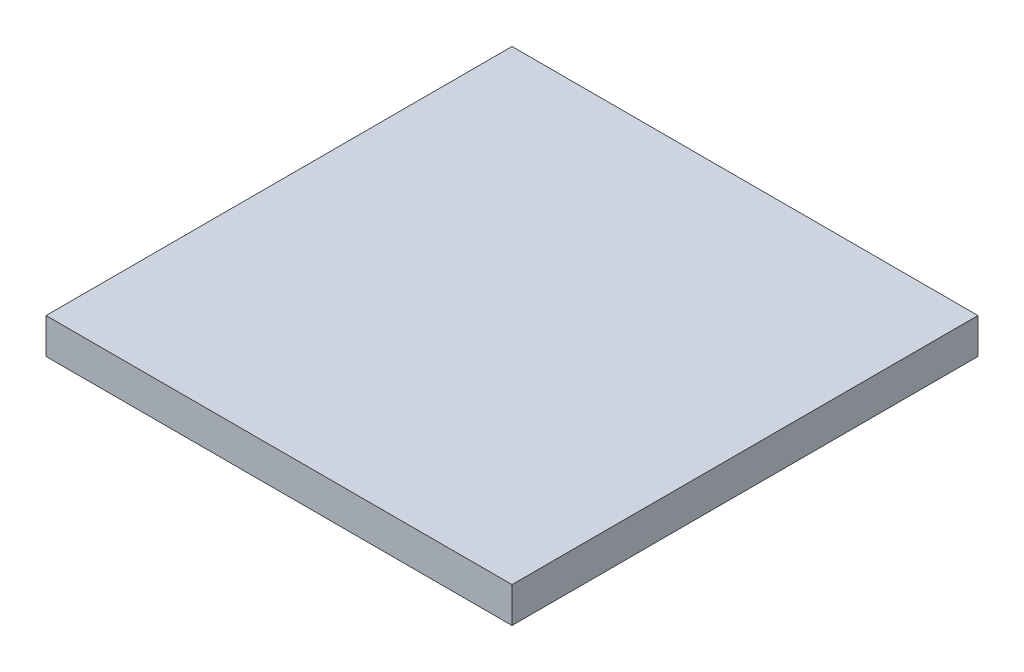
ISO-10303-21;
HEADER;
FILE_DESCRIPTION(('STEP AP214'),'2;1');
FILE_NAME('part.step','',(''),(''),'','','');
FILE_SCHEMA(('AUTOMOTIVE_DESIGN { 1 0 10303 214 1 1 1 1 }'));
ENDSEC;
DATA;
#1=APPLICATION_CONTEXT('core data for automotive mechanical design processes');
#2=APPLICATION_PROTOCOL_DEFINITION('international standard','automotive_design',2000,#1);
#3=PRODUCT_CONTEXT('',#1,'mechanical');
#4=PRODUCT('Part','Part','',(#3));
#5=PRODUCT_RELATED_PRODUCT_CATEGORY('part','',(#4));
#6=PRODUCT_DEFINITION_FORMATION('','',#4);
#7=PRODUCT_DEFINITION_CONTEXT('part definition',#1,'design');
#8=PRODUCT_DEFINITION('design','',#6,#7);
#9=PRODUCT_DEFINITION_SHAPE('','',#8);
#10=(LENGTH_UNIT() NAMED_UNIT(*) SI_UNIT(.MILLI.,.METRE.));
#11=(NAMED_UNIT(*) PLANE_ANGLE_UNIT() SI_UNIT($,.RADIAN.));
#12=(NAMED_UNIT(*) SI_UNIT($,.STERADIAN.) SOLID_ANGLE_UNIT());
#13=UNCERTAINTY_MEASURE_WITH_UNIT(LENGTH_MEASURE(1.E-05),#10,'distance_accuracy_value','');
#14=(GEOMETRIC_REPRESENTATION_CONTEXT(3) GLOBAL_UNCERTAINTY_ASSIGNED_CONTEXT((#13)) GLOBAL_UNIT_ASSIGNED_CONTEXT((#10,
#11,#12)) REPRESENTATION_CONTEXT('',''));
#15=CARTESIAN_POINT('',(0.,0.,0.));
#16=DIRECTION('',(0.,0.,1.));
#17=DIRECTION('',(1.,0.,0.));
#18=AXIS2_PLACEMENT_3D('',#15,#16,#17);
#19=CARTESIAN_POINT('',(0.,10.,-7.76269662921349));
#20=DIRECTION('',(-1.,0.,0.));
#21=DIRECTION('',(0.,0.,1.));
#22=AXIS2_PLACEMENT_3D('',#19,#20,#21);
#23=PLANE('',#22);
#24=DIRECTION('',(0.,0.,-1.));
#25=VECTOR('',#24,1.);
#26=CARTESIAN_POINT('',(0.,0.,-7.76269662921349));
#27=LINE('',#26,#25);
#28=CARTESIAN_POINT('',(0.,0.,-7.76269662921349));
#29=VERTEX_POINT('',#28);
#30=CARTESIAN_POINT('',(0.,0.,-139.212696629214));
#31=VERTEX_POINT('',#30);
#32=EDGE_CURVE('E102',#29,#31,#27,.T.);
#33=ORIENTED_EDGE('',*,*,#32,.T.);
#34=DIRECTION('',(0.,-1.,0.));
#35=VECTOR('',#34,1.);
#36=CARTESIAN_POINT('',(0.,10.,-139.212696629214));
#37=LINE('',#36,#35);
#38=CARTESIAN_POINT('',(0.,10.,-139.212696629214));
#39=VERTEX_POINT('',#38);
#40=EDGE_CURVE('E11',#39,#31,#37,.T.);
#41=ORIENTED_EDGE('',*,*,#40,.F.);
#42=DIRECTION('',(0.,0.,-1.));
#43=VECTOR('',#42,1.);
#44=CARTESIAN_POINT('',(0.,10.,-7.76269662921349));
#45=LINE('',#44,#43);
#46=CARTESIAN_POINT('',(0.,10.,-7.76269662921349));
#47=VERTEX_POINT('',#46);
#48=EDGE_CURVE('E90',#47,#39,#45,.T.);
#49=ORIENTED_EDGE('',*,*,#48,.F.);
#50=DIRECTION('',(0.,-1.,0.));
#51=VECTOR('',#50,1.);
#52=CARTESIAN_POINT('',(0.,10.,-7.76269662921349));
#53=LINE('',#52,#51);
#54=EDGE_CURVE('E98',#47,#29,#53,.T.);
#55=ORIENTED_EDGE('',*,*,#54,.T.);
#56=EDGE_LOOP('',(#33,#41,#49,#55));
#57=FACE_BOUND('',#56,.T.);
#58=ADVANCED_FACE('F39',(#57),#23,.F.);
#59=CARTESIAN_POINT('',(0.,10.,-139.212696629214));
#60=DIRECTION('',(0.,0.,1.));
#61=DIRECTION('',(1.,0.,0.));
#62=AXIS2_PLACEMENT_3D('',#59,#60,#61);
#63=PLANE('',#62);
#64=DIRECTION('',(-1.,0.,0.));
#65=VECTOR('',#64,1.);
#66=CARTESIAN_POINT('',(0.,0.,-139.212696629214));
#67=LINE('',#66,#65);
#68=CARTESIAN_POINT('',(-131.448329588015,0.,-139.212696629213));
#69=VERTEX_POINT('',#68);
#70=EDGE_CURVE('E94',#31,#69,#67,.T.);
#71=ORIENTED_EDGE('',*,*,#70,.T.);
#72=DIRECTION('',(0.,-1.,0.));
#73=VECTOR('',#72,1.);
#74=CARTESIAN_POINT('',(-131.448329588015,10.,-139.212696629213));
#75=LINE('',#74,#73);
#76=CARTESIAN_POINT('',(-131.448329588015,10.,-139.212696629213));
#77=VERTEX_POINT('',#76);
#78=EDGE_CURVE('E47',#77,#69,#75,.T.);
#79=ORIENTED_EDGE('',*,*,#78,.F.);
#80=DIRECTION('',(-1.,0.,0.));
#81=VECTOR('',#80,1.);
#82=CARTESIAN_POINT('',(0.,10.,-139.212696629214));
#83=LINE('',#82,#81);
#84=EDGE_CURVE('E85',#39,#77,#83,.T.);
#85=ORIENTED_EDGE('',*,*,#84,.F.);
#86=ORIENTED_EDGE('',*,*,#40,.T.);
#87=EDGE_LOOP('',(#71,#79,#85,#86));
#88=FACE_BOUND('',#87,.T.);
#89=ADVANCED_FACE('F93',(#88),#63,.F.);
#90=CARTESIAN_POINT('',(-131.448329588015,10.,-7.76269662921349));
#91=DIRECTION('',(1.,0.,0.));
#92=DIRECTION('',(0.,0.,-1.));
#93=AXIS2_PLACEMENT_3D('',#90,#91,#92);
#94=PLANE('',#93);
#95=DIRECTION('',(0.,0.,1.));
#96=VECTOR('',#95,1.);
#97=CARTESIAN_POINT('',(-131.448329588015,0.,-7.76269662921349));
#98=LINE('',#97,#96);
#99=CARTESIAN_POINT('',(-131.448329588015,0.,-7.76269662921349));
#100=VERTEX_POINT('',#99);
#101=EDGE_CURVE('E72',#69,#100,#98,.T.);
#102=ORIENTED_EDGE('',*,*,#101,.T.);
#103=DIRECTION('',(0.,-1.,0.));
#104=VECTOR('',#103,1.);
#105=CARTESIAN_POINT('',(-131.448329588015,10.,-7.76269662921349));
#106=LINE('',#105,#104);
#107=CARTESIAN_POINT('',(-131.448329588015,10.,-7.76269662921349));
#108=VERTEX_POINT('',#107);
#109=EDGE_CURVE('E95',#108,#100,#106,.T.);
#110=ORIENTED_EDGE('',*,*,#109,.F.);
#111=DIRECTION('',(0.,0.,1.));
#112=VECTOR('',#111,1.);
#113=CARTESIAN_POINT('',(-131.448329588015,10.,-7.76269662921349));
#114=LINE('',#113,#112);
#115=EDGE_CURVE('E88',#77,#108,#114,.T.);
#116=ORIENTED_EDGE('',*,*,#115,.F.);
#117=ORIENTED_EDGE('',*,*,#78,.T.);
#118=EDGE_LOOP('',(#102,#110,#116,#117));
#119=FACE_BOUND('',#118,.T.);
#120=ADVANCED_FACE('F96',(#119),#94,.F.);
#121=CARTESIAN_POINT('',(0.,10.,-7.76269662921349));
#122=DIRECTION('',(0.,0.,-1.));
#123=DIRECTION('',(-1.,0.,0.));
#124=AXIS2_PLACEMENT_3D('',#121,#122,#123);
#125=PLANE('',#124);
#126=DIRECTION('',(1.,0.,0.));
#127=VECTOR('',#126,1.);
#128=CARTESIAN_POINT('',(0.,0.,-7.76269662921349));
#129=LINE('',#128,#127);
#130=EDGE_CURVE('E78',#100,#29,#129,.T.);
#131=ORIENTED_EDGE('',*,*,#130,.T.);
#132=ORIENTED_EDGE('',*,*,#54,.F.);
#133=DIRECTION('',(1.,0.,0.));
#134=VECTOR('',#133,1.);
#135=CARTESIAN_POINT('',(0.,10.,-7.76269662921349));
#136=LINE('',#135,#134);
#137=EDGE_CURVE('E55',#108,#47,#136,.T.);
#138=ORIENTED_EDGE('',*,*,#137,.F.);
#139=ORIENTED_EDGE('',*,*,#109,.T.);
#140=EDGE_LOOP('',(#131,#132,#138,#139));
#141=FACE_BOUND('',#140,.T.);
#142=ADVANCED_FACE('F109',(#141),#125,.F.);
#143=CARTESIAN_POINT('',(0.,10.,0.));
#144=DIRECTION('',(0.,1.,0.));
#145=DIRECTION('',(0.,0.,1.));
#146=AXIS2_PLACEMENT_3D('',#143,#144,#145);
#147=PLANE('',#146);
#148=ORIENTED_EDGE('',*,*,#48,.T.);
#149=ORIENTED_EDGE('',*,*,#84,.T.);
#150=ORIENTED_EDGE('',*,*,#115,.T.);
#151=ORIENTED_EDGE('',*,*,#137,.T.);
#152=EDGE_LOOP('',(#148,#149,#150,#151));
#153=FACE_BOUND('',#152,.T.);
#154=ADVANCED_FACE('F86',(#153),#147,.T.);
#155=CARTESIAN_POINT('',(0.,0.,0.));
#156=DIRECTION('',(0.,1.,0.));
#157=DIRECTION('',(0.,0.,1.));
#158=AXIS2_PLACEMENT_3D('',#155,#156,#157);
#159=PLANE('',#158);
#160=ORIENTED_EDGE('',*,*,#32,.F.);
#161=ORIENTED_EDGE('',*,*,#130,.F.);
#162=ORIENTED_EDGE('',*,*,#101,.F.);
#163=ORIENTED_EDGE('',*,*,#70,.F.);
#164=EDGE_LOOP('',(#160,#161,#162,#163));
#165=FACE_BOUND('',#164,.T.);
#166=ADVANCED_FACE('F112',(#165),#159,.F.);
#167=CLOSED_SHELL('',(#58,#89,#120,#142,#154,#166));
#168=MANIFOLD_SOLID_BREP('B2',#167);
#169=ADVANCED_BREP_SHAPE_REPRESENTATION('',(#18,#168),#14);
#170=SHAPE_DEFINITION_REPRESENTATION(#9,#169);
ENDSEC;
END-ISO-10303-21;
